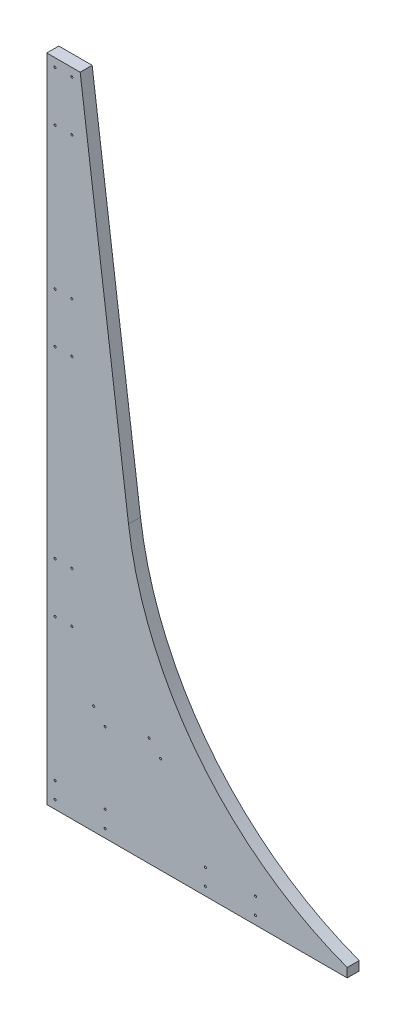
ISO-10303-21;
HEADER;
FILE_DESCRIPTION(('STEP AP214'),'2;1');
FILE_NAME('part.step','',(''),(''),'','','');
FILE_SCHEMA(('AUTOMOTIVE_DESIGN { 1 0 10303 214 1 1 1 1 }'));
ENDSEC;
DATA;
#1=APPLICATION_CONTEXT('core data for automotive mechanical design processes');
#2=APPLICATION_PROTOCOL_DEFINITION('international standard','automotive_design',2000,#1);
#3=PRODUCT_CONTEXT('',#1,'mechanical');
#4=PRODUCT('Part','Part','',(#3));
#5=PRODUCT_RELATED_PRODUCT_CATEGORY('part','',(#4));
#6=PRODUCT_DEFINITION_FORMATION('','',#4);
#7=PRODUCT_DEFINITION_CONTEXT('part definition',#1,'design');
#8=PRODUCT_DEFINITION('design','',#6,#7);
#9=PRODUCT_DEFINITION_SHAPE('','',#8);
#10=(LENGTH_UNIT() NAMED_UNIT(*) SI_UNIT(.MILLI.,.METRE.));
#11=(NAMED_UNIT(*) PLANE_ANGLE_UNIT() SI_UNIT($,.RADIAN.));
#12=(NAMED_UNIT(*) SI_UNIT($,.STERADIAN.) SOLID_ANGLE_UNIT());
#13=UNCERTAINTY_MEASURE_WITH_UNIT(LENGTH_MEASURE(1.E-05),#10,'distance_accuracy_value','');
#14=(GEOMETRIC_REPRESENTATION_CONTEXT(3) GLOBAL_UNCERTAINTY_ASSIGNED_CONTEXT((#13)) GLOBAL_UNIT_ASSIGNED_CONTEXT((#10,
#11,#12)) REPRESENTATION_CONTEXT('',''));
#15=CARTESIAN_POINT('',(0.,0.,0.));
#16=DIRECTION('',(0.,0.,1.));
#17=DIRECTION('',(1.,0.,0.));
#18=AXIS2_PLACEMENT_3D('',#15,#16,#17);
#19=CARTESIAN_POINT('',(638.116559349375,499.436357901165,18.25625));
#20=DIRECTION('',(0.,0.,-1.));
#21=DIRECTION('',(-1.,0.,0.));
#22=AXIS2_PLACEMENT_3D('',#19,#20,#21);
#23=CYLINDRICAL_SURFACE('',#22,518.182264806593);
#24=CARTESIAN_POINT('',(638.116559349375,499.436357901165,0.));
#25=DIRECTION('',(0.,0.,1.));
#26=DIRECTION('',(1.,0.,0.));
#27=AXIS2_PLACEMENT_3D('',#24,#25,#26);
#28=CIRCLE('',#27,518.182264806593);
#29=CARTESIAN_POINT('',(124.367415651835,431.8,0.));
#30=VERTEX_POINT('',#29);
#31=CARTESIAN_POINT('',(457.201,13.8620382080899,0.));
#32=VERTEX_POINT('',#31);
#33=EDGE_CURVE('E127',#30,#32,#28,.T.);
#34=ORIENTED_EDGE('',*,*,#33,.F.);
#35=DIRECTION('',(0.,0.,-1.));
#36=VECTOR('',#35,1.);
#37=CARTESIAN_POINT('',(124.367415651835,431.8,18.25625));
#38=LINE('',#37,#36);
#39=CARTESIAN_POINT('',(124.367415651835,431.8,18.25625));
#40=VERTEX_POINT('',#39);
#41=EDGE_CURVE('E11',#40,#30,#38,.T.);
#42=ORIENTED_EDGE('',*,*,#41,.F.);
#43=CARTESIAN_POINT('',(638.116559349375,499.436357901165,18.25625));
#44=DIRECTION('',(0.,0.,1.));
#45=DIRECTION('',(1.,0.,0.));
#46=AXIS2_PLACEMENT_3D('',#43,#44,#45);
#47=CIRCLE('',#46,518.182264806593);
#48=CARTESIAN_POINT('',(457.201,13.8620382080899,18.25625));
#49=VERTEX_POINT('',#48);
#50=EDGE_CURVE('E142',#40,#49,#47,.T.);
#51=ORIENTED_EDGE('',*,*,#50,.T.);
#52=DIRECTION('',(0.,0.,-1.));
#53=VECTOR('',#52,1.);
#54=CARTESIAN_POINT('',(457.201,13.8620382080899,18.25625));
#55=LINE('',#54,#53);
#56=EDGE_CURVE('E60',#49,#32,#55,.T.);
#57=ORIENTED_EDGE('',*,*,#56,.T.);
#58=EDGE_LOOP('',(#34,#42,#51,#57));
#59=FACE_BOUND('',#58,.T.);
#60=ADVANCED_FACE('F44',(#59),#23,.F.);
#61=CARTESIAN_POINT('',(178.127589027018,23.4509419846275,18.25625));
#62=DIRECTION('',(0.991444861373811,0.130526192220048,0.));
#63=DIRECTION('',(-0.130526192220048,0.991444861373811,0.));
#64=AXIS2_PLACEMENT_3D('',#61,#62,#63);
#65=PLANE('',#64);
#66=DIRECTION('',(0.130526192220048,-0.991444861373811,0.));
#67=VECTOR('',#66,1.);
#68=CARTESIAN_POINT('',(178.127589027018,23.4509419846275,0.));
#69=LINE('',#68,#67);
#70=CARTESIAN_POINT('',(50.8,990.6,0.));
#71=VERTEX_POINT('',#70);
#72=EDGE_CURVE('E129',#71,#30,#69,.T.);
#73=ORIENTED_EDGE('',*,*,#72,.F.);
#74=DIRECTION('',(0.,0.,-1.));
#75=VECTOR('',#74,1.);
#76=CARTESIAN_POINT('',(50.8,990.6,18.25625));
#77=LINE('',#76,#75);
#78=CARTESIAN_POINT('',(50.8,990.6,18.25625));
#79=VERTEX_POINT('',#78);
#80=EDGE_CURVE('E52',#79,#71,#77,.T.);
#81=ORIENTED_EDGE('',*,*,#80,.F.);
#82=DIRECTION('',(0.130526192220048,-0.991444861373811,0.));
#83=VECTOR('',#82,1.);
#84=CARTESIAN_POINT('',(178.127589027018,23.4509419846275,18.25625));
#85=LINE('',#84,#83);
#86=EDGE_CURVE('E122',#79,#40,#85,.T.);
#87=ORIENTED_EDGE('',*,*,#86,.T.);
#88=ORIENTED_EDGE('',*,*,#41,.T.);
#89=EDGE_LOOP('',(#73,#81,#87,#88));
#90=FACE_BOUND('',#89,.T.);
#91=ADVANCED_FACE('F151',(#90),#65,.T.);
#92=CARTESIAN_POINT('',(0.,990.6,18.25625));
#93=DIRECTION('',(0.,1.,0.));
#94=DIRECTION('',(0.,0.,1.));
#95=AXIS2_PLACEMENT_3D('',#92,#93,#94);
#96=PLANE('',#95);
#97=DIRECTION('',(1.,0.,0.));
#98=VECTOR('',#97,1.);
#99=CARTESIAN_POINT('',(0.,990.6,0.));
#100=LINE('',#99,#98);
#101=CARTESIAN_POINT('',(0.,990.6,0.));
#102=VERTEX_POINT('',#101);
#103=EDGE_CURVE('E133',#102,#71,#100,.T.);
#104=ORIENTED_EDGE('',*,*,#103,.F.);
#105=DIRECTION('',(0.,0.,-1.));
#106=VECTOR('',#105,1.);
#107=CARTESIAN_POINT('',(0.,990.6,18.25625));
#108=LINE('',#107,#106);
#109=CARTESIAN_POINT('',(0.,990.6,18.25625));
#110=VERTEX_POINT('',#109);
#111=EDGE_CURVE('E108',#110,#102,#108,.T.);
#112=ORIENTED_EDGE('',*,*,#111,.F.);
#113=DIRECTION('',(1.,0.,0.));
#114=VECTOR('',#113,1.);
#115=CARTESIAN_POINT('',(0.,990.6,18.25625));
#116=LINE('',#115,#114);
#117=EDGE_CURVE('E120',#110,#79,#116,.T.);
#118=ORIENTED_EDGE('',*,*,#117,.T.);
#119=ORIENTED_EDGE('',*,*,#80,.T.);
#120=EDGE_LOOP('',(#104,#112,#118,#119));
#121=FACE_BOUND('',#120,.T.);
#122=ADVANCED_FACE('F148',(#121),#96,.T.);
#123=CARTESIAN_POINT('',(0.,0.,18.25625));
#124=DIRECTION('',(-1.,0.,0.));
#125=DIRECTION('',(0.,0.,1.));
#126=AXIS2_PLACEMENT_3D('',#123,#124,#125);
#127=PLANE('',#126);
#128=DIRECTION('',(0.,1.,0.));
#129=VECTOR('',#128,1.);
#130=CARTESIAN_POINT('',(0.,0.,0.));
#131=LINE('',#130,#129);
#132=CARTESIAN_POINT('',(0.,0.,0.));
#133=VERTEX_POINT('',#132);
#134=EDGE_CURVE('E105',#133,#102,#131,.T.);
#135=ORIENTED_EDGE('',*,*,#134,.F.);
#136=DIRECTION('',(0.,0.,-1.));
#137=VECTOR('',#136,1.);
#138=CARTESIAN_POINT('',(0.,0.,18.25625));
#139=LINE('',#138,#137);
#140=CARTESIAN_POINT('',(0.,0.,18.25625));
#141=VERTEX_POINT('',#140);
#142=EDGE_CURVE('E99',#141,#133,#139,.T.);
#143=ORIENTED_EDGE('',*,*,#142,.F.);
#144=DIRECTION('',(0.,1.,0.));
#145=VECTOR('',#144,1.);
#146=CARTESIAN_POINT('',(0.,0.,18.25625));
#147=LINE('',#146,#145);
#148=EDGE_CURVE('E103',#141,#110,#147,.T.);
#149=ORIENTED_EDGE('',*,*,#148,.T.);
#150=ORIENTED_EDGE('',*,*,#111,.T.);
#151=EDGE_LOOP('',(#135,#143,#149,#150));
#152=FACE_BOUND('',#151,.T.);
#153=ADVANCED_FACE('F101',(#152),#127,.T.);
#154=CARTESIAN_POINT('',(0.,0.,18.25625));
#155=DIRECTION('',(0.,1.,0.));
#156=DIRECTION('',(0.,0.,1.));
#157=AXIS2_PLACEMENT_3D('',#154,#155,#156);
#158=PLANE('',#157);
#159=DIRECTION('',(1.,0.,0.));
#160=VECTOR('',#159,1.);
#161=CARTESIAN_POINT('',(0.,0.,0.));
#162=LINE('',#161,#160);
#163=CARTESIAN_POINT('',(457.201,0.,0.));
#164=VERTEX_POINT('',#163);
#165=EDGE_CURVE('E137',#133,#164,#162,.T.);
#166=ORIENTED_EDGE('',*,*,#165,.T.);
#167=DIRECTION('',(0.,0.,-1.));
#168=VECTOR('',#167,1.);
#169=CARTESIAN_POINT('',(457.201,0.,18.25625));
#170=LINE('',#169,#168);
#171=CARTESIAN_POINT('',(457.201,0.,18.25625));
#172=VERTEX_POINT('',#171);
#173=EDGE_CURVE('E80',#172,#164,#170,.T.);
#174=ORIENTED_EDGE('',*,*,#173,.F.);
#175=DIRECTION('',(1.,0.,0.));
#176=VECTOR('',#175,1.);
#177=CARTESIAN_POINT('',(0.,0.,18.25625));
#178=LINE('',#177,#176);
#179=EDGE_CURVE('E110',#141,#172,#178,.T.);
#180=ORIENTED_EDGE('',*,*,#179,.F.);
#181=ORIENTED_EDGE('',*,*,#142,.T.);
#182=EDGE_LOOP('',(#166,#174,#180,#181));
#183=FACE_BOUND('',#182,.T.);
#184=ADVANCED_FACE('F111',(#183),#158,.F.);
#185=CARTESIAN_POINT('',(457.201,0.,18.25625));
#186=DIRECTION('',(1.,0.,0.));
#187=DIRECTION('',(0.,0.,-1.));
#188=AXIS2_PLACEMENT_3D('',#185,#186,#187);
#189=PLANE('',#188);
#190=DIRECTION('',(0.,-1.,0.));
#191=VECTOR('',#190,1.);
#192=CARTESIAN_POINT('',(457.201,0.,0.));
#193=LINE('',#192,#191);
#194=EDGE_CURVE('E139',#32,#164,#193,.T.);
#195=ORIENTED_EDGE('',*,*,#194,.F.);
#196=ORIENTED_EDGE('',*,*,#56,.F.);
#197=DIRECTION('',(0.,-1.,0.));
#198=VECTOR('',#197,1.);
#199=CARTESIAN_POINT('',(457.201,0.,18.25625));
#200=LINE('',#199,#198);
#201=EDGE_CURVE('E114',#49,#172,#200,.T.);
#202=ORIENTED_EDGE('',*,*,#201,.T.);
#203=ORIENTED_EDGE('',*,*,#173,.T.);
#204=EDGE_LOOP('',(#195,#196,#202,#203));
#205=FACE_BOUND('',#204,.T.);
#206=ADVANCED_FACE('F154',(#205),#189,.T.);
#207=CARTESIAN_POINT('',(0.,0.,18.25625));
#208=DIRECTION('',(0.,0.,1.));
#209=DIRECTION('',(1.,0.,0.));
#210=AXIS2_PLACEMENT_3D('',#207,#208,#209);
#211=PLANE('',#210);
#212=CARTESIAN_POINT('',(173.2788,147.112433493281,18.25625));
#213=DIRECTION('',(0.,0.,1.));
#214=DIRECTION('',(1.,0.,0.));
#215=AXIS2_PLACEMENT_3D('',#212,#213,#214);
#216=CIRCLE('',#215,1.58749999999999);
#217=CARTESIAN_POINT('',(174.8663,147.112433493281,18.25625));
#218=VERTEX_POINT('',#217);
#219=EDGE_CURVE('E451',#218,#218,#216,.T.);
#220=ORIENTED_EDGE('',*,*,#219,.F.);
#221=EDGE_LOOP('',(#220));
#222=FACE_BOUND('',#221,.T.);
#223=CARTESIAN_POINT('',(155.8036,165.527433493281,18.25625));
#224=DIRECTION('',(0.,0.,1.));
#225=DIRECTION('',(1.,0.,0.));
#226=AXIS2_PLACEMENT_3D('',#223,#224,#225);
#227=CIRCLE('',#226,1.58749999999999);
#228=CARTESIAN_POINT('',(157.3911,165.527433493281,18.25625));
#229=VERTEX_POINT('',#228);
#230=EDGE_CURVE('E453',#229,#229,#227,.T.);
#231=ORIENTED_EDGE('',*,*,#230,.F.);
#232=EDGE_LOOP('',(#231));
#233=FACE_BOUND('',#232,.T.);
#234=CARTESIAN_POINT('',(71.4248,165.527433493281,18.25625));
#235=DIRECTION('',(0.,0.,1.));
#236=DIRECTION('',(1.,0.,0.));
#237=AXIS2_PLACEMENT_3D('',#234,#235,#236);
#238=CIRCLE('',#237,1.5875);
#239=CARTESIAN_POINT('',(73.0123,165.527433493281,18.25625));
#240=VERTEX_POINT('',#239);
#241=EDGE_CURVE('E688',#240,#240,#238,.T.);
#242=ORIENTED_EDGE('',*,*,#241,.F.);
#243=EDGE_LOOP('',(#242));
#244=FACE_BOUND('',#243,.T.);
#245=CARTESIAN_POINT('',(88.9,147.112433493281,18.25625));
#246=DIRECTION('',(0.,0.,1.));
#247=DIRECTION('',(1.,0.,0.));
#248=AXIS2_PLACEMENT_3D('',#245,#246,#247);
#249=CIRCLE('',#248,1.5875);
#250=CARTESIAN_POINT('',(90.4875,147.112433493281,18.25625));
#251=VERTEX_POINT('',#250);
#252=EDGE_CURVE('E462',#251,#251,#249,.T.);
#253=ORIENTED_EDGE('',*,*,#252,.F.);
#254=EDGE_LOOP('',(#253));
#255=FACE_BOUND('',#254,.T.);
#256=CARTESIAN_POINT('',(12.7000000000001,38.0999999999999,18.25625));
#257=DIRECTION('',(0.,0.,1.));
#258=DIRECTION('',(1.,0.,0.));
#259=AXIS2_PLACEMENT_3D('',#256,#257,#258);
#260=CIRCLE('',#259,1.5875);
#261=CARTESIAN_POINT('',(14.2875000000001,38.0999999999999,18.25625));
#262=VERTEX_POINT('',#261);
#263=EDGE_CURVE('E500',#262,#262,#260,.T.);
#264=ORIENTED_EDGE('',*,*,#263,.F.);
#265=EDGE_LOOP('',(#264));
#266=FACE_BOUND('',#265,.T.);
#267=CARTESIAN_POINT('',(38.1000000000001,330.2,18.25625));
#268=DIRECTION('',(0.,0.,1.));
#269=DIRECTION('',(1.,0.,0.));
#270=AXIS2_PLACEMENT_3D('',#267,#268,#269);
#271=CIRCLE('',#270,1.58750000000001);
#272=CARTESIAN_POINT('',(39.6875000000001,330.2,18.25625));
#273=VERTEX_POINT('',#272);
#274=EDGE_CURVE('E513',#273,#273,#271,.T.);
#275=ORIENTED_EDGE('',*,*,#274,.F.);
#276=EDGE_LOOP('',(#275));
#277=FACE_BOUND('',#276,.T.);
#278=CARTESIAN_POINT('',(12.7000000000001,330.2,18.25625));
#279=DIRECTION('',(0.,0.,1.));
#280=DIRECTION('',(1.,0.,0.));
#281=AXIS2_PLACEMENT_3D('',#278,#279,#280);
#282=CIRCLE('',#281,1.5875);
#283=CARTESIAN_POINT('',(14.2875000000001,330.2,18.25625));
#284=VERTEX_POINT('',#283);
#285=EDGE_CURVE('E512',#284,#284,#282,.T.);
#286=ORIENTED_EDGE('',*,*,#285,.F.);
#287=EDGE_LOOP('',(#286));
#288=FACE_BOUND('',#287,.T.);
#289=CARTESIAN_POINT('',(38.1000000000001,254.,18.25625));
#290=DIRECTION('',(0.,0.,1.));
#291=DIRECTION('',(1.,0.,0.));
#292=AXIS2_PLACEMENT_3D('',#289,#290,#291);
#293=CIRCLE('',#292,1.58750000000006);
#294=CARTESIAN_POINT('',(39.6875000000001,254.,18.25625));
#295=VERTEX_POINT('',#294);
#296=EDGE_CURVE('E525',#295,#295,#293,.T.);
#297=ORIENTED_EDGE('',*,*,#296,.F.);
#298=EDGE_LOOP('',(#297));
#299=FACE_BOUND('',#298,.T.);
#300=CARTESIAN_POINT('',(241.3,38.0999999999999,18.25625));
#301=DIRECTION('',(0.,0.,1.));
#302=DIRECTION('',(1.,0.,0.));
#303=AXIS2_PLACEMENT_3D('',#300,#301,#302);
#304=CIRCLE('',#303,1.58749999999999);
#305=CARTESIAN_POINT('',(242.8875,38.0999999999999,18.25625));
#306=VERTEX_POINT('',#305);
#307=EDGE_CURVE('E476',#306,#306,#304,.T.);
#308=ORIENTED_EDGE('',*,*,#307,.F.);
#309=EDGE_LOOP('',(#308));
#310=FACE_BOUND('',#309,.T.);
#311=CARTESIAN_POINT('',(88.9000000000001,12.6999999999999,18.25625));
#312=DIRECTION('',(0.,0.,1.));
#313=DIRECTION('',(1.,0.,0.));
#314=AXIS2_PLACEMENT_3D('',#311,#312,#313);
#315=CIRCLE('',#314,1.58749999999998);
#316=CARTESIAN_POINT('',(90.4875000000001,12.6999999999999,18.25625));
#317=VERTEX_POINT('',#316);
#318=EDGE_CURVE('E489',#317,#317,#315,.T.);
#319=ORIENTED_EDGE('',*,*,#318,.F.);
#320=EDGE_LOOP('',(#319));
#321=FACE_BOUND('',#320,.T.);
#322=CARTESIAN_POINT('',(88.9000000000001,38.0999999999999,18.25625));
#323=DIRECTION('',(0.,0.,1.));
#324=DIRECTION('',(1.,0.,0.));
#325=AXIS2_PLACEMENT_3D('',#322,#323,#324);
#326=CIRCLE('',#325,1.58749999999999);
#327=CARTESIAN_POINT('',(90.4875000000001,38.0999999999999,18.25625));
#328=VERTEX_POINT('',#327);
#329=EDGE_CURVE('E488',#328,#328,#326,.T.);
#330=ORIENTED_EDGE('',*,*,#329,.F.);
#331=EDGE_LOOP('',(#330));
#332=FACE_BOUND('',#331,.T.);
#333=CARTESIAN_POINT('',(12.7000000000001,12.6999999999999,18.25625));
#334=DIRECTION('',(0.,0.,1.));
#335=DIRECTION('',(1.,0.,0.));
#336=AXIS2_PLACEMENT_3D('',#333,#334,#335);
#337=CIRCLE('',#336,1.5875);
#338=CARTESIAN_POINT('',(14.2875000000001,12.6999999999999,18.25625));
#339=VERTEX_POINT('',#338);
#340=EDGE_CURVE('E501',#339,#339,#337,.T.);
#341=ORIENTED_EDGE('',*,*,#340,.F.);
#342=EDGE_LOOP('',(#341));
#343=FACE_BOUND('',#342,.T.);
#344=CARTESIAN_POINT('',(12.7,609.6,18.25625));
#345=DIRECTION('',(0.,0.,1.));
#346=DIRECTION('',(1.,0.,0.));
#347=AXIS2_PLACEMENT_3D('',#344,#345,#346);
#348=CIRCLE('',#347,1.58750000000007);
#349=CARTESIAN_POINT('',(14.2875000000001,609.6,18.25625));
#350=VERTEX_POINT('',#349);
#351=EDGE_CURVE('E548',#350,#350,#348,.T.);
#352=ORIENTED_EDGE('',*,*,#351,.F.);
#353=EDGE_LOOP('',(#352));
#354=FACE_BOUND('',#353,.T.);
#355=CARTESIAN_POINT('',(38.1,901.7,18.25625));
#356=DIRECTION('',(0.,0.,1.));
#357=DIRECTION('',(1.,0.,0.));
#358=AXIS2_PLACEMENT_3D('',#355,#356,#357);
#359=CIRCLE('',#358,1.58750000000008);
#360=CARTESIAN_POINT('',(39.6875000000001,901.7,18.25625));
#361=VERTEX_POINT('',#360);
#362=EDGE_CURVE('E561',#361,#361,#359,.T.);
#363=ORIENTED_EDGE('',*,*,#362,.F.);
#364=EDGE_LOOP('',(#363));
#365=FACE_BOUND('',#364,.T.);
#366=CARTESIAN_POINT('',(12.7,901.7,18.25625));
#367=DIRECTION('',(0.,0.,1.));
#368=DIRECTION('',(1.,0.,0.));
#369=AXIS2_PLACEMENT_3D('',#366,#367,#368);
#370=CIRCLE('',#369,1.58750000000007);
#371=CARTESIAN_POINT('',(14.2875000000001,901.7,18.25625));
#372=VERTEX_POINT('',#371);
#373=EDGE_CURVE('E560',#372,#372,#370,.T.);
#374=ORIENTED_EDGE('',*,*,#373,.F.);
#375=EDGE_LOOP('',(#374));
#376=FACE_BOUND('',#375,.T.);
#377=CARTESIAN_POINT('',(38.1,977.9,18.25625));
#378=DIRECTION('',(0.,0.,1.));
#379=DIRECTION('',(1.,0.,0.));
#380=AXIS2_PLACEMENT_3D('',#377,#378,#379);
#381=CIRCLE('',#380,1.58750000000007);
#382=CARTESIAN_POINT('',(39.6875000000001,977.9,18.25625));
#383=VERTEX_POINT('',#382);
#384=EDGE_CURVE('E573',#383,#383,#381,.T.);
#385=ORIENTED_EDGE('',*,*,#384,.F.);
#386=EDGE_LOOP('',(#385));
#387=FACE_BOUND('',#386,.T.);
#388=CARTESIAN_POINT('',(12.7000000000001,254.,18.25625));
#389=DIRECTION('',(0.,0.,1.));
#390=DIRECTION('',(1.,0.,0.));
#391=AXIS2_PLACEMENT_3D('',#388,#389,#390);
#392=CIRCLE('',#391,1.58750000000002);
#393=CARTESIAN_POINT('',(14.2875000000001,254.,18.25625));
#394=VERTEX_POINT('',#393);
#395=EDGE_CURVE('E524',#394,#394,#392,.T.);
#396=ORIENTED_EDGE('',*,*,#395,.F.);
#397=EDGE_LOOP('',(#396));
#398=FACE_BOUND('',#397,.T.);
#399=CARTESIAN_POINT('',(38.1,685.8,18.25625));
#400=DIRECTION('',(0.,0.,1.));
#401=DIRECTION('',(1.,0.,0.));
#402=AXIS2_PLACEMENT_3D('',#399,#400,#401);
#403=CIRCLE('',#402,1.58750000000007);
#404=CARTESIAN_POINT('',(39.6875000000001,685.8,18.25625));
#405=VERTEX_POINT('',#404);
#406=EDGE_CURVE('E537',#405,#405,#403,.T.);
#407=ORIENTED_EDGE('',*,*,#406,.F.);
#408=EDGE_LOOP('',(#407));
#409=FACE_BOUND('',#408,.T.);
#410=CARTESIAN_POINT('',(12.7,685.8,18.25625));
#411=DIRECTION('',(0.,0.,1.));
#412=DIRECTION('',(1.,0.,0.));
#413=AXIS2_PLACEMENT_3D('',#410,#411,#412);
#414=CIRCLE('',#413,1.58750000000004);
#415=CARTESIAN_POINT('',(14.2875000000001,685.8,18.25625));
#416=VERTEX_POINT('',#415);
#417=EDGE_CURVE('E536',#416,#416,#414,.T.);
#418=ORIENTED_EDGE('',*,*,#417,.F.);
#419=EDGE_LOOP('',(#418));
#420=FACE_BOUND('',#419,.T.);
#421=CARTESIAN_POINT('',(38.1000000000001,609.6,18.25625));
#422=DIRECTION('',(0.,0.,1.));
#423=DIRECTION('',(1.,0.,0.));
#424=AXIS2_PLACEMENT_3D('',#421,#422,#423);
#425=CIRCLE('',#424,1.58750000000007);
#426=CARTESIAN_POINT('',(39.6875000000001,609.6,18.25625));
#427=VERTEX_POINT('',#426);
#428=EDGE_CURVE('E549',#427,#427,#425,.T.);
#429=ORIENTED_EDGE('',*,*,#428,.F.);
#430=EDGE_LOOP('',(#429));
#431=FACE_BOUND('',#430,.T.);
#432=CARTESIAN_POINT('',(317.5,12.6999999999999,18.25625));
#433=DIRECTION('',(0.,0.,1.));
#434=DIRECTION('',(1.,0.,0.));
#435=AXIS2_PLACEMENT_3D('',#432,#433,#434);
#436=CIRCLE('',#435,1.58750000000004);
#437=CARTESIAN_POINT('',(319.0875,12.6999999999999,18.25625));
#438=VERTEX_POINT('',#437);
#439=EDGE_CURVE('E461',#438,#438,#436,.T.);
#440=ORIENTED_EDGE('',*,*,#439,.F.);
#441=EDGE_LOOP('',(#440));
#442=FACE_BOUND('',#441,.T.);
#443=CARTESIAN_POINT('',(241.3,12.6999999999999,18.25625));
#444=DIRECTION('',(0.,0.,1.));
#445=DIRECTION('',(1.,0.,0.));
#446=AXIS2_PLACEMENT_3D('',#443,#444,#445);
#447=CIRCLE('',#446,1.58749999999999);
#448=CARTESIAN_POINT('',(242.8875,12.6999999999999,18.25625));
#449=VERTEX_POINT('',#448);
#450=EDGE_CURVE('E470',#449,#449,#447,.T.);
#451=ORIENTED_EDGE('',*,*,#450,.F.);
#452=EDGE_LOOP('',(#451));
#453=FACE_BOUND('',#452,.T.);
#454=CARTESIAN_POINT('',(317.5,38.0999999999999,18.25625));
#455=DIRECTION('',(0.,0.,1.));
#456=DIRECTION('',(1.,0.,0.));
#457=AXIS2_PLACEMENT_3D('',#454,#455,#456);
#458=CIRCLE('',#457,1.58750000000004);
#459=CARTESIAN_POINT('',(319.0875,38.0999999999999,18.25625));
#460=VERTEX_POINT('',#459);
#461=EDGE_CURVE('E477',#460,#460,#458,.T.);
#462=ORIENTED_EDGE('',*,*,#461,.F.);
#463=EDGE_LOOP('',(#462));
#464=FACE_BOUND('',#463,.T.);
#465=CARTESIAN_POINT('',(12.7,977.9,18.25625));
#466=DIRECTION('',(0.,0.,1.));
#467=DIRECTION('',(1.,0.,0.));
#468=AXIS2_PLACEMENT_3D('',#465,#466,#467);
#469=CIRCLE('',#468,1.58750000000004);
#470=CARTESIAN_POINT('',(14.2875,977.9,18.25625));
#471=VERTEX_POINT('',#470);
#472=EDGE_CURVE('E572',#471,#471,#469,.T.);
#473=ORIENTED_EDGE('',*,*,#472,.F.);
#474=EDGE_LOOP('',(#473));
#475=FACE_BOUND('',#474,.T.);
#476=ORIENTED_EDGE('',*,*,#50,.F.);
#477=ORIENTED_EDGE('',*,*,#86,.F.);
#478=ORIENTED_EDGE('',*,*,#117,.F.);
#479=ORIENTED_EDGE('',*,*,#148,.F.);
#480=ORIENTED_EDGE('',*,*,#179,.T.);
#481=ORIENTED_EDGE('',*,*,#201,.F.);
#482=EDGE_LOOP('',(#476,#477,#478,#479,#480,#481));
#483=FACE_BOUND('',#482,.T.);
#484=ADVANCED_FACE('F117',(#222,#233,#244,#255,#266,#277,#288,#299,#310,#321,#332,#343,#354,
#365,#376,#387,#398,#409,#420,#431,#442,#453,#464,#475,#483),#211,.T.);
#485=CARTESIAN_POINT('',(0.,0.,0.));
#486=DIRECTION('',(0.,0.,1.));
#487=DIRECTION('',(1.,0.,0.));
#488=AXIS2_PLACEMENT_3D('',#485,#486,#487);
#489=PLANE('',#488);
#490=CARTESIAN_POINT('',(173.2788,147.112433493281,0.));
#491=DIRECTION('',(0.,0.,1.));
#492=DIRECTION('',(1.,0.,0.));
#493=AXIS2_PLACEMENT_3D('',#490,#491,#492);
#494=CIRCLE('',#493,1.58749999999999);
#495=CARTESIAN_POINT('',(174.8663,147.112433493281,0.));
#496=VERTEX_POINT('',#495);
#497=EDGE_CURVE('E448',#496,#496,#494,.T.);
#498=ORIENTED_EDGE('',*,*,#497,.T.);
#499=EDGE_LOOP('',(#498));
#500=FACE_BOUND('',#499,.T.);
#501=CARTESIAN_POINT('',(155.8036,165.527433493281,0.));
#502=DIRECTION('',(0.,0.,1.));
#503=DIRECTION('',(1.,0.,0.));
#504=AXIS2_PLACEMENT_3D('',#501,#502,#503);
#505=CIRCLE('',#504,1.58749999999999);
#506=CARTESIAN_POINT('',(157.3911,165.527433493281,0.));
#507=VERTEX_POINT('',#506);
#508=EDGE_CURVE('E693',#507,#507,#505,.T.);
#509=ORIENTED_EDGE('',*,*,#508,.T.);
#510=EDGE_LOOP('',(#509));
#511=FACE_BOUND('',#510,.T.);
#512=CARTESIAN_POINT('',(71.4248,165.527433493281,0.));
#513=DIRECTION('',(0.,0.,1.));
#514=DIRECTION('',(1.,0.,0.));
#515=AXIS2_PLACEMENT_3D('',#512,#513,#514);
#516=CIRCLE('',#515,1.5875);
#517=CARTESIAN_POINT('',(73.0123,165.527433493281,0.));
#518=VERTEX_POINT('',#517);
#519=EDGE_CURVE('E466',#518,#518,#516,.T.);
#520=ORIENTED_EDGE('',*,*,#519,.T.);
#521=EDGE_LOOP('',(#520));
#522=FACE_BOUND('',#521,.T.);
#523=CARTESIAN_POINT('',(88.9,147.112433493281,0.));
#524=DIRECTION('',(0.,0.,1.));
#525=DIRECTION('',(1.,0.,0.));
#526=AXIS2_PLACEMENT_3D('',#523,#524,#525);
#527=CIRCLE('',#526,1.5875);
#528=CARTESIAN_POINT('',(90.4875,147.112433493281,0.));
#529=VERTEX_POINT('',#528);
#530=EDGE_CURVE('E457',#529,#529,#527,.T.);
#531=ORIENTED_EDGE('',*,*,#530,.T.);
#532=EDGE_LOOP('',(#531));
#533=FACE_BOUND('',#532,.T.);
#534=CARTESIAN_POINT('',(12.7000000000001,38.0999999999999,0.));
#535=DIRECTION('',(0.,0.,1.));
#536=DIRECTION('',(1.,0.,0.));
#537=AXIS2_PLACEMENT_3D('',#534,#535,#536);
#538=CIRCLE('',#537,1.5875);
#539=CARTESIAN_POINT('',(14.2875000000001,38.0999999999999,0.));
#540=VERTEX_POINT('',#539);
#541=EDGE_CURVE('E516',#540,#540,#538,.T.);
#542=ORIENTED_EDGE('',*,*,#541,.T.);
#543=EDGE_LOOP('',(#542));
#544=FACE_BOUND('',#543,.T.);
#545=CARTESIAN_POINT('',(38.1000000000001,330.2,0.));
#546=DIRECTION('',(0.,0.,1.));
#547=DIRECTION('',(1.,0.,0.));
#548=AXIS2_PLACEMENT_3D('',#545,#546,#547);
#549=CIRCLE('',#548,1.58750000000001);
#550=CARTESIAN_POINT('',(39.6875000000001,330.2,0.));
#551=VERTEX_POINT('',#550);
#552=EDGE_CURVE('E509',#551,#551,#549,.T.);
#553=ORIENTED_EDGE('',*,*,#552,.T.);
#554=EDGE_LOOP('',(#553));
#555=FACE_BOUND('',#554,.T.);
#556=CARTESIAN_POINT('',(12.7000000000001,330.2,0.));
#557=DIRECTION('',(0.,0.,1.));
#558=DIRECTION('',(1.,0.,0.));
#559=AXIS2_PLACEMENT_3D('',#556,#557,#558);
#560=CIRCLE('',#559,1.5875);
#561=CARTESIAN_POINT('',(14.2875000000001,330.2,0.));
#562=VERTEX_POINT('',#561);
#563=EDGE_CURVE('E528',#562,#562,#560,.T.);
#564=ORIENTED_EDGE('',*,*,#563,.T.);
#565=EDGE_LOOP('',(#564));
#566=FACE_BOUND('',#565,.T.);
#567=CARTESIAN_POINT('',(38.1000000000001,254.,0.));
#568=DIRECTION('',(0.,0.,1.));
#569=DIRECTION('',(1.,0.,0.));
#570=AXIS2_PLACEMENT_3D('',#567,#568,#569);
#571=CIRCLE('',#570,1.58750000000006);
#572=CARTESIAN_POINT('',(39.6875000000001,254.,0.));
#573=VERTEX_POINT('',#572);
#574=EDGE_CURVE('E521',#573,#573,#571,.T.);
#575=ORIENTED_EDGE('',*,*,#574,.T.);
#576=EDGE_LOOP('',(#575));
#577=FACE_BOUND('',#576,.T.);
#578=CARTESIAN_POINT('',(241.3,38.0999999999999,0.));
#579=DIRECTION('',(0.,0.,1.));
#580=DIRECTION('',(1.,0.,0.));
#581=AXIS2_PLACEMENT_3D('',#578,#579,#580);
#582=CIRCLE('',#581,1.58749999999999);
#583=CARTESIAN_POINT('',(242.8875,38.0999999999999,0.));
#584=VERTEX_POINT('',#583);
#585=EDGE_CURVE('E492',#584,#584,#582,.T.);
#586=ORIENTED_EDGE('',*,*,#585,.T.);
#587=EDGE_LOOP('',(#586));
#588=FACE_BOUND('',#587,.T.);
#589=CARTESIAN_POINT('',(88.9000000000001,12.6999999999999,0.));
#590=DIRECTION('',(0.,0.,1.));
#591=DIRECTION('',(1.,0.,0.));
#592=AXIS2_PLACEMENT_3D('',#589,#590,#591);
#593=CIRCLE('',#592,1.58749999999998);
#594=CARTESIAN_POINT('',(90.4875000000001,12.6999999999999,0.));
#595=VERTEX_POINT('',#594);
#596=EDGE_CURVE('E485',#595,#595,#593,.T.);
#597=ORIENTED_EDGE('',*,*,#596,.T.);
#598=EDGE_LOOP('',(#597));
#599=FACE_BOUND('',#598,.T.);
#600=CARTESIAN_POINT('',(88.9000000000001,38.0999999999999,0.));
#601=DIRECTION('',(0.,0.,1.));
#602=DIRECTION('',(1.,0.,0.));
#603=AXIS2_PLACEMENT_3D('',#600,#601,#602);
#604=CIRCLE('',#603,1.58749999999999);
#605=CARTESIAN_POINT('',(90.4875000000001,38.0999999999999,0.));
#606=VERTEX_POINT('',#605);
#607=EDGE_CURVE('E504',#606,#606,#604,.T.);
#608=ORIENTED_EDGE('',*,*,#607,.T.);
#609=EDGE_LOOP('',(#608));
#610=FACE_BOUND('',#609,.T.);
#611=CARTESIAN_POINT('',(12.7000000000001,12.6999999999999,0.));
#612=DIRECTION('',(0.,0.,1.));
#613=DIRECTION('',(1.,0.,0.));
#614=AXIS2_PLACEMENT_3D('',#611,#612,#613);
#615=CIRCLE('',#614,1.5875);
#616=CARTESIAN_POINT('',(14.2875000000001,12.6999999999999,0.));
#617=VERTEX_POINT('',#616);
#618=EDGE_CURVE('E497',#617,#617,#615,.T.);
#619=ORIENTED_EDGE('',*,*,#618,.T.);
#620=EDGE_LOOP('',(#619));
#621=FACE_BOUND('',#620,.T.);
#622=CARTESIAN_POINT('',(12.7,609.6,0.));
#623=DIRECTION('',(0.,0.,1.));
#624=DIRECTION('',(1.,0.,0.));
#625=AXIS2_PLACEMENT_3D('',#622,#623,#624);
#626=CIRCLE('',#625,1.58750000000007);
#627=CARTESIAN_POINT('',(14.2875000000001,609.6,0.));
#628=VERTEX_POINT('',#627);
#629=EDGE_CURVE('E564',#628,#628,#626,.T.);
#630=ORIENTED_EDGE('',*,*,#629,.T.);
#631=EDGE_LOOP('',(#630));
#632=FACE_BOUND('',#631,.T.);
#633=CARTESIAN_POINT('',(38.1,901.7,0.));
#634=DIRECTION('',(0.,0.,1.));
#635=DIRECTION('',(1.,0.,0.));
#636=AXIS2_PLACEMENT_3D('',#633,#634,#635);
#637=CIRCLE('',#636,1.58750000000008);
#638=CARTESIAN_POINT('',(39.6875000000001,901.7,0.));
#639=VERTEX_POINT('',#638);
#640=EDGE_CURVE('E557',#639,#639,#637,.T.);
#641=ORIENTED_EDGE('',*,*,#640,.T.);
#642=EDGE_LOOP('',(#641));
#643=FACE_BOUND('',#642,.T.);
#644=CARTESIAN_POINT('',(12.7,901.7,0.));
#645=DIRECTION('',(0.,0.,1.));
#646=DIRECTION('',(1.,0.,0.));
#647=AXIS2_PLACEMENT_3D('',#644,#645,#646);
#648=CIRCLE('',#647,1.58750000000007);
#649=CARTESIAN_POINT('',(14.2875000000001,901.7,0.));
#650=VERTEX_POINT('',#649);
#651=EDGE_CURVE('E576',#650,#650,#648,.T.);
#652=ORIENTED_EDGE('',*,*,#651,.T.);
#653=EDGE_LOOP('',(#652));
#654=FACE_BOUND('',#653,.T.);
#655=CARTESIAN_POINT('',(38.1,977.9,0.));
#656=DIRECTION('',(0.,0.,1.));
#657=DIRECTION('',(1.,0.,0.));
#658=AXIS2_PLACEMENT_3D('',#655,#656,#657);
#659=CIRCLE('',#658,1.58750000000007);
#660=CARTESIAN_POINT('',(39.6875000000001,977.9,0.));
#661=VERTEX_POINT('',#660);
#662=EDGE_CURVE('E569',#661,#661,#659,.T.);
#663=ORIENTED_EDGE('',*,*,#662,.T.);
#664=EDGE_LOOP('',(#663));
#665=FACE_BOUND('',#664,.T.);
#666=CARTESIAN_POINT('',(12.7000000000001,254.,0.));
#667=DIRECTION('',(0.,0.,1.));
#668=DIRECTION('',(1.,0.,0.));
#669=AXIS2_PLACEMENT_3D('',#666,#667,#668);
#670=CIRCLE('',#669,1.58750000000002);
#671=CARTESIAN_POINT('',(14.2875000000001,254.,0.));
#672=VERTEX_POINT('',#671);
#673=EDGE_CURVE('E540',#672,#672,#670,.T.);
#674=ORIENTED_EDGE('',*,*,#673,.T.);
#675=EDGE_LOOP('',(#674));
#676=FACE_BOUND('',#675,.T.);
#677=CARTESIAN_POINT('',(38.1,685.8,0.));
#678=DIRECTION('',(0.,0.,1.));
#679=DIRECTION('',(1.,0.,0.));
#680=AXIS2_PLACEMENT_3D('',#677,#678,#679);
#681=CIRCLE('',#680,1.58750000000007);
#682=CARTESIAN_POINT('',(39.6875000000001,685.8,0.));
#683=VERTEX_POINT('',#682);
#684=EDGE_CURVE('E533',#683,#683,#681,.T.);
#685=ORIENTED_EDGE('',*,*,#684,.T.);
#686=EDGE_LOOP('',(#685));
#687=FACE_BOUND('',#686,.T.);
#688=CARTESIAN_POINT('',(12.7,685.8,0.));
#689=DIRECTION('',(0.,0.,1.));
#690=DIRECTION('',(1.,0.,0.));
#691=AXIS2_PLACEMENT_3D('',#688,#689,#690);
#692=CIRCLE('',#691,1.58750000000004);
#693=CARTESIAN_POINT('',(14.2875000000001,685.8,0.));
#694=VERTEX_POINT('',#693);
#695=EDGE_CURVE('E552',#694,#694,#692,.T.);
#696=ORIENTED_EDGE('',*,*,#695,.T.);
#697=EDGE_LOOP('',(#696));
#698=FACE_BOUND('',#697,.T.);
#699=CARTESIAN_POINT('',(38.1000000000001,609.6,0.));
#700=DIRECTION('',(0.,0.,1.));
#701=DIRECTION('',(1.,0.,0.));
#702=AXIS2_PLACEMENT_3D('',#699,#700,#701);
#703=CIRCLE('',#702,1.58750000000007);
#704=CARTESIAN_POINT('',(39.6875000000001,609.6,0.));
#705=VERTEX_POINT('',#704);
#706=EDGE_CURVE('E545',#705,#705,#703,.T.);
#707=ORIENTED_EDGE('',*,*,#706,.T.);
#708=EDGE_LOOP('',(#707));
#709=FACE_BOUND('',#708,.T.);
#710=CARTESIAN_POINT('',(317.5,12.6999999999999,0.));
#711=DIRECTION('',(0.,0.,1.));
#712=DIRECTION('',(1.,0.,0.));
#713=AXIS2_PLACEMENT_3D('',#710,#711,#712);
#714=CIRCLE('',#713,1.58750000000004);
#715=CARTESIAN_POINT('',(319.0875,12.6999999999999,0.));
#716=VERTEX_POINT('',#715);
#717=EDGE_CURVE('E467',#716,#716,#714,.T.);
#718=ORIENTED_EDGE('',*,*,#717,.T.);
#719=EDGE_LOOP('',(#718));
#720=FACE_BOUND('',#719,.T.);
#721=CARTESIAN_POINT('',(241.3,12.6999999999999,0.));
#722=DIRECTION('',(0.,0.,1.));
#723=DIRECTION('',(1.,0.,0.));
#724=AXIS2_PLACEMENT_3D('',#721,#722,#723);
#725=CIRCLE('',#724,1.58749999999999);
#726=CARTESIAN_POINT('',(242.8875,12.6999999999999,0.));
#727=VERTEX_POINT('',#726);
#728=EDGE_CURVE('E480',#727,#727,#725,.T.);
#729=ORIENTED_EDGE('',*,*,#728,.T.);
#730=EDGE_LOOP('',(#729));
#731=FACE_BOUND('',#730,.T.);
#732=CARTESIAN_POINT('',(317.5,38.0999999999999,0.));
#733=DIRECTION('',(0.,0.,1.));
#734=DIRECTION('',(1.,0.,0.));
#735=AXIS2_PLACEMENT_3D('',#732,#733,#734);
#736=CIRCLE('',#735,1.58750000000004);
#737=CARTESIAN_POINT('',(319.0875,38.0999999999999,0.));
#738=VERTEX_POINT('',#737);
#739=EDGE_CURVE('E473',#738,#738,#736,.T.);
#740=ORIENTED_EDGE('',*,*,#739,.T.);
#741=EDGE_LOOP('',(#740));
#742=FACE_BOUND('',#741,.T.);
#743=CARTESIAN_POINT('',(12.7,977.9,0.));
#744=DIRECTION('',(0.,0.,1.));
#745=DIRECTION('',(1.,0.,0.));
#746=AXIS2_PLACEMENT_3D('',#743,#744,#745);
#747=CIRCLE('',#746,1.58750000000004);
#748=CARTESIAN_POINT('',(14.2875,977.9,0.));
#749=VERTEX_POINT('',#748);
#750=EDGE_CURVE('E130',#749,#749,#747,.T.);
#751=ORIENTED_EDGE('',*,*,#750,.T.);
#752=EDGE_LOOP('',(#751));
#753=FACE_BOUND('',#752,.T.);
#754=ORIENTED_EDGE('',*,*,#33,.T.);
#755=ORIENTED_EDGE('',*,*,#194,.T.);
#756=ORIENTED_EDGE('',*,*,#165,.F.);
#757=ORIENTED_EDGE('',*,*,#134,.T.);
#758=ORIENTED_EDGE('',*,*,#103,.T.);
#759=ORIENTED_EDGE('',*,*,#72,.T.);
#760=EDGE_LOOP('',(#754,#755,#756,#757,#758,#759));
#761=FACE_BOUND('',#760,.T.);
#762=ADVANCED_FACE('F153',(#500,#511,#522,#533,#544,#555,#566,#577,#588,#599,#610,#621,#632,
#643,#654,#665,#676,#687,#698,#709,#720,#731,#742,#753,#761),#489,.F.);
#763=CARTESIAN_POINT('',(12.7,977.9,0.));
#764=DIRECTION('',(0.,0.,1.));
#765=DIRECTION('',(1.,0.,0.));
#766=AXIS2_PLACEMENT_3D('',#763,#764,#765);
#767=CYLINDRICAL_SURFACE('',#766,1.58750000000004);
#768=ORIENTED_EDGE('',*,*,#750,.F.);
#769=EDGE_LOOP('',(#768));
#770=FACE_BOUND('',#769,.T.);
#771=ORIENTED_EDGE('',*,*,#472,.T.);
#772=EDGE_LOOP('',(#771));
#773=FACE_BOUND('',#772,.T.);
#774=ADVANCED_FACE('F193',(#770,#773),#767,.F.);
#775=CARTESIAN_POINT('',(317.5,38.0999999999999,0.));
#776=DIRECTION('',(0.,0.,1.));
#777=DIRECTION('',(1.,0.,0.));
#778=AXIS2_PLACEMENT_3D('',#775,#776,#777);
#779=CYLINDRICAL_SURFACE('',#778,1.58750000000004);
#780=ORIENTED_EDGE('',*,*,#739,.F.);
#781=EDGE_LOOP('',(#780));
#782=FACE_BOUND('',#781,.T.);
#783=ORIENTED_EDGE('',*,*,#461,.T.);
#784=EDGE_LOOP('',(#783));
#785=FACE_BOUND('',#784,.T.);
#786=ADVANCED_FACE('F198',(#782,#785),#779,.F.);
#787=CARTESIAN_POINT('',(241.3,12.6999999999999,0.));
#788=DIRECTION('',(0.,0.,1.));
#789=DIRECTION('',(1.,0.,0.));
#790=AXIS2_PLACEMENT_3D('',#787,#788,#789);
#791=CYLINDRICAL_SURFACE('',#790,1.58749999999999);
#792=ORIENTED_EDGE('',*,*,#728,.F.);
#793=EDGE_LOOP('',(#792));
#794=FACE_BOUND('',#793,.T.);
#795=ORIENTED_EDGE('',*,*,#450,.T.);
#796=EDGE_LOOP('',(#795));
#797=FACE_BOUND('',#796,.T.);
#798=ADVANCED_FACE('F210',(#794,#797),#791,.F.);
#799=CARTESIAN_POINT('',(317.5,12.6999999999999,0.));
#800=DIRECTION('',(0.,0.,1.));
#801=DIRECTION('',(1.,0.,0.));
#802=AXIS2_PLACEMENT_3D('',#799,#800,#801);
#803=CYLINDRICAL_SURFACE('',#802,1.58750000000004);
#804=ORIENTED_EDGE('',*,*,#717,.F.);
#805=EDGE_LOOP('',(#804));
#806=FACE_BOUND('',#805,.T.);
#807=ORIENTED_EDGE('',*,*,#439,.T.);
#808=EDGE_LOOP('',(#807));
#809=FACE_BOUND('',#808,.T.);
#810=ADVANCED_FACE('F220',(#806,#809),#803,.F.);
#811=CARTESIAN_POINT('',(38.1000000000001,609.6,0.));
#812=DIRECTION('',(0.,0.,1.));
#813=DIRECTION('',(1.,0.,0.));
#814=AXIS2_PLACEMENT_3D('',#811,#812,#813);
#815=CYLINDRICAL_SURFACE('',#814,1.58750000000007);
#816=ORIENTED_EDGE('',*,*,#706,.F.);
#817=EDGE_LOOP('',(#816));
#818=FACE_BOUND('',#817,.T.);
#819=ORIENTED_EDGE('',*,*,#428,.T.);
#820=EDGE_LOOP('',(#819));
#821=FACE_BOUND('',#820,.T.);
#822=ADVANCED_FACE('F230',(#818,#821),#815,.F.);
#823=CARTESIAN_POINT('',(12.7,685.8,0.));
#824=DIRECTION('',(0.,0.,1.));
#825=DIRECTION('',(1.,0.,0.));
#826=AXIS2_PLACEMENT_3D('',#823,#824,#825);
#827=CYLINDRICAL_SURFACE('',#826,1.58750000000004);
#828=ORIENTED_EDGE('',*,*,#695,.F.);
#829=EDGE_LOOP('',(#828));
#830=FACE_BOUND('',#829,.T.);
#831=ORIENTED_EDGE('',*,*,#417,.T.);
#832=EDGE_LOOP('',(#831));
#833=FACE_BOUND('',#832,.T.);
#834=ADVANCED_FACE('F240',(#830,#833),#827,.F.);
#835=CARTESIAN_POINT('',(38.1,685.8,0.));
#836=DIRECTION('',(0.,0.,1.));
#837=DIRECTION('',(1.,0.,0.));
#838=AXIS2_PLACEMENT_3D('',#835,#836,#837);
#839=CYLINDRICAL_SURFACE('',#838,1.58750000000007);
#840=ORIENTED_EDGE('',*,*,#684,.F.);
#841=EDGE_LOOP('',(#840));
#842=FACE_BOUND('',#841,.T.);
#843=ORIENTED_EDGE('',*,*,#406,.T.);
#844=EDGE_LOOP('',(#843));
#845=FACE_BOUND('',#844,.T.);
#846=ADVANCED_FACE('F250',(#842,#845),#839,.F.);
#847=CARTESIAN_POINT('',(12.7000000000001,254.,0.));
#848=DIRECTION('',(0.,0.,1.));
#849=DIRECTION('',(1.,0.,0.));
#850=AXIS2_PLACEMENT_3D('',#847,#848,#849);
#851=CYLINDRICAL_SURFACE('',#850,1.58750000000002);
#852=ORIENTED_EDGE('',*,*,#673,.F.);
#853=EDGE_LOOP('',(#852));
#854=FACE_BOUND('',#853,.T.);
#855=ORIENTED_EDGE('',*,*,#395,.T.);
#856=EDGE_LOOP('',(#855));
#857=FACE_BOUND('',#856,.T.);
#858=ADVANCED_FACE('F260',(#854,#857),#851,.F.);
#859=CARTESIAN_POINT('',(38.1,977.9,0.));
#860=DIRECTION('',(0.,0.,1.));
#861=DIRECTION('',(1.,0.,0.));
#862=AXIS2_PLACEMENT_3D('',#859,#860,#861);
#863=CYLINDRICAL_SURFACE('',#862,1.58750000000007);
#864=ORIENTED_EDGE('',*,*,#662,.F.);
#865=EDGE_LOOP('',(#864));
#866=FACE_BOUND('',#865,.T.);
#867=ORIENTED_EDGE('',*,*,#384,.T.);
#868=EDGE_LOOP('',(#867));
#869=FACE_BOUND('',#868,.T.);
#870=ADVANCED_FACE('F270',(#866,#869),#863,.F.);
#871=CARTESIAN_POINT('',(12.7,901.7,0.));
#872=DIRECTION('',(0.,0.,1.));
#873=DIRECTION('',(1.,0.,0.));
#874=AXIS2_PLACEMENT_3D('',#871,#872,#873);
#875=CYLINDRICAL_SURFACE('',#874,1.58750000000007);
#876=ORIENTED_EDGE('',*,*,#651,.F.);
#877=EDGE_LOOP('',(#876));
#878=FACE_BOUND('',#877,.T.);
#879=ORIENTED_EDGE('',*,*,#373,.T.);
#880=EDGE_LOOP('',(#879));
#881=FACE_BOUND('',#880,.T.);
#882=ADVANCED_FACE('F280',(#878,#881),#875,.F.);
#883=CARTESIAN_POINT('',(38.1,901.7,0.));
#884=DIRECTION('',(0.,0.,1.));
#885=DIRECTION('',(1.,0.,0.));
#886=AXIS2_PLACEMENT_3D('',#883,#884,#885);
#887=CYLINDRICAL_SURFACE('',#886,1.58750000000008);
#888=ORIENTED_EDGE('',*,*,#640,.F.);
#889=EDGE_LOOP('',(#888));
#890=FACE_BOUND('',#889,.T.);
#891=ORIENTED_EDGE('',*,*,#362,.T.);
#892=EDGE_LOOP('',(#891));
#893=FACE_BOUND('',#892,.T.);
#894=ADVANCED_FACE('F290',(#890,#893),#887,.F.);
#895=CARTESIAN_POINT('',(12.7,609.6,0.));
#896=DIRECTION('',(0.,0.,1.));
#897=DIRECTION('',(1.,0.,0.));
#898=AXIS2_PLACEMENT_3D('',#895,#896,#897);
#899=CYLINDRICAL_SURFACE('',#898,1.58750000000007);
#900=ORIENTED_EDGE('',*,*,#629,.F.);
#901=EDGE_LOOP('',(#900));
#902=FACE_BOUND('',#901,.T.);
#903=ORIENTED_EDGE('',*,*,#351,.T.);
#904=EDGE_LOOP('',(#903));
#905=FACE_BOUND('',#904,.T.);
#906=ADVANCED_FACE('F300',(#902,#905),#899,.F.);
#907=CARTESIAN_POINT('',(12.7000000000001,12.6999999999999,0.));
#908=DIRECTION('',(0.,0.,1.));
#909=DIRECTION('',(1.,0.,0.));
#910=AXIS2_PLACEMENT_3D('',#907,#908,#909);
#911=CYLINDRICAL_SURFACE('',#910,1.5875);
#912=ORIENTED_EDGE('',*,*,#618,.F.);
#913=EDGE_LOOP('',(#912));
#914=FACE_BOUND('',#913,.T.);
#915=ORIENTED_EDGE('',*,*,#340,.T.);
#916=EDGE_LOOP('',(#915));
#917=FACE_BOUND('',#916,.T.);
#918=ADVANCED_FACE('F310',(#914,#917),#911,.F.);
#919=CARTESIAN_POINT('',(88.9000000000001,38.0999999999999,0.));
#920=DIRECTION('',(0.,0.,1.));
#921=DIRECTION('',(1.,0.,0.));
#922=AXIS2_PLACEMENT_3D('',#919,#920,#921);
#923=CYLINDRICAL_SURFACE('',#922,1.58749999999999);
#924=ORIENTED_EDGE('',*,*,#607,.F.);
#925=EDGE_LOOP('',(#924));
#926=FACE_BOUND('',#925,.T.);
#927=ORIENTED_EDGE('',*,*,#329,.T.);
#928=EDGE_LOOP('',(#927));
#929=FACE_BOUND('',#928,.T.);
#930=ADVANCED_FACE('F320',(#926,#929),#923,.F.);
#931=CARTESIAN_POINT('',(88.9000000000001,12.6999999999999,0.));
#932=DIRECTION('',(0.,0.,1.));
#933=DIRECTION('',(1.,0.,0.));
#934=AXIS2_PLACEMENT_3D('',#931,#932,#933);
#935=CYLINDRICAL_SURFACE('',#934,1.58749999999998);
#936=ORIENTED_EDGE('',*,*,#596,.F.);
#937=EDGE_LOOP('',(#936));
#938=FACE_BOUND('',#937,.T.);
#939=ORIENTED_EDGE('',*,*,#318,.T.);
#940=EDGE_LOOP('',(#939));
#941=FACE_BOUND('',#940,.T.);
#942=ADVANCED_FACE('F330',(#938,#941),#935,.F.);
#943=CARTESIAN_POINT('',(241.3,38.0999999999999,0.));
#944=DIRECTION('',(0.,0.,1.));
#945=DIRECTION('',(1.,0.,0.));
#946=AXIS2_PLACEMENT_3D('',#943,#944,#945);
#947=CYLINDRICAL_SURFACE('',#946,1.58749999999999);
#948=ORIENTED_EDGE('',*,*,#585,.F.);
#949=EDGE_LOOP('',(#948));
#950=FACE_BOUND('',#949,.T.);
#951=ORIENTED_EDGE('',*,*,#307,.T.);
#952=EDGE_LOOP('',(#951));
#953=FACE_BOUND('',#952,.T.);
#954=ADVANCED_FACE('F340',(#950,#953),#947,.F.);
#955=CARTESIAN_POINT('',(38.1000000000001,254.,0.));
#956=DIRECTION('',(0.,0.,1.));
#957=DIRECTION('',(1.,0.,0.));
#958=AXIS2_PLACEMENT_3D('',#955,#956,#957);
#959=CYLINDRICAL_SURFACE('',#958,1.58750000000006);
#960=ORIENTED_EDGE('',*,*,#574,.F.);
#961=EDGE_LOOP('',(#960));
#962=FACE_BOUND('',#961,.T.);
#963=ORIENTED_EDGE('',*,*,#296,.T.);
#964=EDGE_LOOP('',(#963));
#965=FACE_BOUND('',#964,.T.);
#966=ADVANCED_FACE('F350',(#962,#965),#959,.F.);
#967=CARTESIAN_POINT('',(12.7000000000001,330.2,0.));
#968=DIRECTION('',(0.,0.,1.));
#969=DIRECTION('',(1.,0.,0.));
#970=AXIS2_PLACEMENT_3D('',#967,#968,#969);
#971=CYLINDRICAL_SURFACE('',#970,1.5875);
#972=ORIENTED_EDGE('',*,*,#563,.F.);
#973=EDGE_LOOP('',(#972));
#974=FACE_BOUND('',#973,.T.);
#975=ORIENTED_EDGE('',*,*,#285,.T.);
#976=EDGE_LOOP('',(#975));
#977=FACE_BOUND('',#976,.T.);
#978=ADVANCED_FACE('F360',(#974,#977),#971,.F.);
#979=CARTESIAN_POINT('',(38.1000000000001,330.2,0.));
#980=DIRECTION('',(0.,0.,1.));
#981=DIRECTION('',(1.,0.,0.));
#982=AXIS2_PLACEMENT_3D('',#979,#980,#981);
#983=CYLINDRICAL_SURFACE('',#982,1.58750000000001);
#984=ORIENTED_EDGE('',*,*,#552,.F.);
#985=EDGE_LOOP('',(#984));
#986=FACE_BOUND('',#985,.T.);
#987=ORIENTED_EDGE('',*,*,#274,.T.);
#988=EDGE_LOOP('',(#987));
#989=FACE_BOUND('',#988,.T.);
#990=ADVANCED_FACE('F370',(#986,#989),#983,.F.);
#991=CARTESIAN_POINT('',(12.7000000000001,38.0999999999999,0.));
#992=DIRECTION('',(0.,0.,1.));
#993=DIRECTION('',(1.,0.,0.));
#994=AXIS2_PLACEMENT_3D('',#991,#992,#993);
#995=CYLINDRICAL_SURFACE('',#994,1.5875);
#996=ORIENTED_EDGE('',*,*,#541,.F.);
#997=EDGE_LOOP('',(#996));
#998=FACE_BOUND('',#997,.T.);
#999=ORIENTED_EDGE('',*,*,#263,.T.);
#1000=EDGE_LOOP('',(#999));
#1001=FACE_BOUND('',#1000,.T.);
#1002=ADVANCED_FACE('F380',(#998,#1001),#995,.F.);
#1003=CARTESIAN_POINT('',(88.9,147.112433493281,0.));
#1004=DIRECTION('',(0.,0.,1.));
#1005=DIRECTION('',(1.,0.,0.));
#1006=AXIS2_PLACEMENT_3D('',#1003,#1004,#1005);
#1007=CYLINDRICAL_SURFACE('',#1006,1.5875);
#1008=ORIENTED_EDGE('',*,*,#530,.F.);
#1009=EDGE_LOOP('',(#1008));
#1010=FACE_BOUND('',#1009,.T.);
#1011=ORIENTED_EDGE('',*,*,#252,.T.);
#1012=EDGE_LOOP('',(#1011));
#1013=FACE_BOUND('',#1012,.T.);
#1014=ADVANCED_FACE('F390',(#1010,#1013),#1007,.F.);
#1015=CARTESIAN_POINT('',(71.4248,165.527433493281,0.));
#1016=DIRECTION('',(0.,0.,1.));
#1017=DIRECTION('',(1.,0.,0.));
#1018=AXIS2_PLACEMENT_3D('',#1015,#1016,#1017);
#1019=CYLINDRICAL_SURFACE('',#1018,1.5875);
#1020=ORIENTED_EDGE('',*,*,#519,.F.);
#1021=EDGE_LOOP('',(#1020));
#1022=FACE_BOUND('',#1021,.T.);
#1023=ORIENTED_EDGE('',*,*,#241,.T.);
#1024=EDGE_LOOP('',(#1023));
#1025=FACE_BOUND('',#1024,.T.);
#1026=ADVANCED_FACE('F411',(#1022,#1025),#1019,.F.);
#1027=CARTESIAN_POINT('',(155.8036,165.527433493281,0.));
#1028=DIRECTION('',(0.,0.,1.));
#1029=DIRECTION('',(1.,0.,0.));
#1030=AXIS2_PLACEMENT_3D('',#1027,#1028,#1029);
#1031=CYLINDRICAL_SURFACE('',#1030,1.58749999999999);
#1032=ORIENTED_EDGE('',*,*,#508,.F.);
#1033=EDGE_LOOP('',(#1032));
#1034=FACE_BOUND('',#1033,.T.);
#1035=ORIENTED_EDGE('',*,*,#230,.T.);
#1036=EDGE_LOOP('',(#1035));
#1037=FACE_BOUND('',#1036,.T.);
#1038=ADVANCED_FACE('F421',(#1034,#1037),#1031,.F.);
#1039=CARTESIAN_POINT('',(173.2788,147.112433493281,0.));
#1040=DIRECTION('',(0.,0.,1.));
#1041=DIRECTION('',(1.,0.,0.));
#1042=AXIS2_PLACEMENT_3D('',#1039,#1040,#1041);
#1043=CYLINDRICAL_SURFACE('',#1042,1.58749999999999);
#1044=ORIENTED_EDGE('',*,*,#497,.F.);
#1045=EDGE_LOOP('',(#1044));
#1046=FACE_BOUND('',#1045,.T.);
#1047=ORIENTED_EDGE('',*,*,#219,.T.);
#1048=EDGE_LOOP('',(#1047));
#1049=FACE_BOUND('',#1048,.T.);
#1050=ADVANCED_FACE('F431',(#1046,#1049),#1043,.F.);
#1051=CLOSED_SHELL('',(#60,#91,#122,#153,#184,#206,#484,#762,#774,#786,#798,#810,#822,#834,#846,
#858,#870,#882,#894,#906,#918,#930,#942,#954,#966,#978,#990,#1002,#1014,#1026,#1038,#1050));
#1052=MANIFOLD_SOLID_BREP('B2',#1051);
#1053=ADVANCED_BREP_SHAPE_REPRESENTATION('',(#18,#1052),#14);
#1054=SHAPE_DEFINITION_REPRESENTATION(#9,#1053);
ENDSEC;
END-ISO-10303-21;
